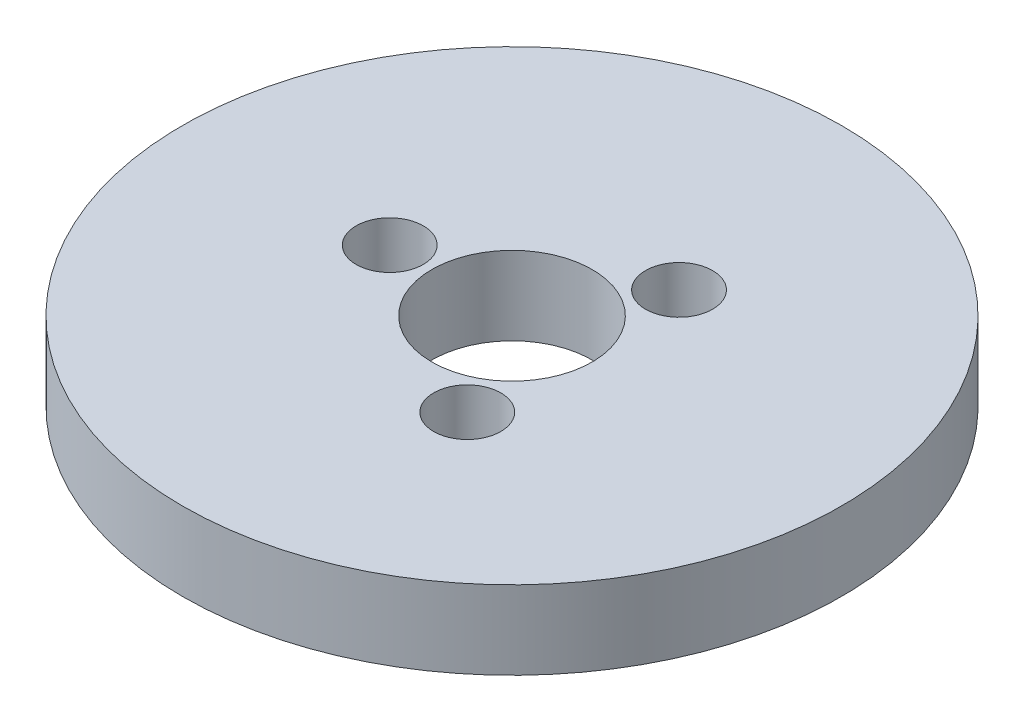
ISO-10303-21;
HEADER;
FILE_DESCRIPTION(('STEP AP214'),'2;1');
FILE_NAME('part.step','',(''),(''),'','','');
FILE_SCHEMA(('AUTOMOTIVE_DESIGN { 1 0 10303 214 1 1 1 1 }'));
ENDSEC;
DATA;
#1=APPLICATION_CONTEXT('core data for automotive mechanical design processes');
#2=APPLICATION_PROTOCOL_DEFINITION('international standard','automotive_design',2000,#1);
#3=PRODUCT_CONTEXT('',#1,'mechanical');
#4=PRODUCT('Part','Part','',(#3));
#5=PRODUCT_RELATED_PRODUCT_CATEGORY('part','',(#4));
#6=PRODUCT_DEFINITION_FORMATION('','',#4);
#7=PRODUCT_DEFINITION_CONTEXT('part definition',#1,'design');
#8=PRODUCT_DEFINITION('design','',#6,#7);
#9=PRODUCT_DEFINITION_SHAPE('','',#8);
#10=(LENGTH_UNIT() NAMED_UNIT(*) SI_UNIT(.MILLI.,.METRE.));
#11=(NAMED_UNIT(*) PLANE_ANGLE_UNIT() SI_UNIT($,.RADIAN.));
#12=(NAMED_UNIT(*) SI_UNIT($,.STERADIAN.) SOLID_ANGLE_UNIT());
#13=UNCERTAINTY_MEASURE_WITH_UNIT(LENGTH_MEASURE(1.E-05),#10,'distance_accuracy_value','');
#14=(GEOMETRIC_REPRESENTATION_CONTEXT(3) GLOBAL_UNCERTAINTY_ASSIGNED_CONTEXT((#13)) GLOBAL_UNIT_ASSIGNED_CONTEXT((#10,
#11,#12)) REPRESENTATION_CONTEXT('',''));
#15=CARTESIAN_POINT('',(0.,0.,0.));
#16=DIRECTION('',(0.,0.,1.));
#17=DIRECTION('',(1.,0.,0.));
#18=AXIS2_PLACEMENT_3D('',#15,#16,#17);
#19=CARTESIAN_POINT('',(0.,22.,0.));
#20=DIRECTION('',(0.,-1.,0.));
#21=DIRECTION('',(0.,0.,-1.));
#22=AXIS2_PLACEMENT_3D('',#19,#20,#21);
#23=CYLINDRICAL_SURFACE('',#22,92.5);
#24=CARTESIAN_POINT('',(0.,22.,0.));
#25=DIRECTION('',(0.,1.,0.));
#26=DIRECTION('',(0.,0.,1.));
#27=AXIS2_PLACEMENT_3D('',#24,#25,#26);
#28=CIRCLE('',#27,92.5);
#29=CARTESIAN_POINT('',(0.,22.,92.5));
#30=VERTEX_POINT('',#29);
#31=EDGE_CURVE('E10',#30,#30,#28,.T.);
#32=ORIENTED_EDGE('',*,*,#31,.F.);
#33=EDGE_LOOP('',(#32));
#34=FACE_BOUND('',#33,.T.);
#35=CARTESIAN_POINT('',(0.,0.,0.));
#36=DIRECTION('',(0.,1.,0.));
#37=DIRECTION('',(0.,0.,1.));
#38=AXIS2_PLACEMENT_3D('',#35,#36,#37);
#39=CIRCLE('',#38,92.5);
#40=CARTESIAN_POINT('',(0.,0.,92.5));
#41=VERTEX_POINT('',#40);
#42=EDGE_CURVE('E37',#41,#41,#39,.T.);
#43=ORIENTED_EDGE('',*,*,#42,.T.);
#44=EDGE_LOOP('',(#43));
#45=FACE_BOUND('',#44,.T.);
#46=ADVANCED_FACE('F40',(#34,#45),#23,.T.);
#47=CARTESIAN_POINT('',(0.,22.,0.));
#48=DIRECTION('',(0.,1.,0.));
#49=DIRECTION('',(0.,0.,1.));
#50=AXIS2_PLACEMENT_3D('',#47,#48,#49);
#51=PLANE('',#50);
#52=CARTESIAN_POINT('',(17.1618556363531,22.,29.7252059143255));
#53=DIRECTION('',(0.,1.,0.));
#54=DIRECTION('',(0.866025403784436,0.,-0.500000000000004));
#55=AXIS2_PLACEMENT_3D('',#52,#53,#54);
#56=CIRCLE('',#55,9.41448918018023);
#57=CARTESIAN_POINT('',(25.3150424300429,22.,25.0179613242354));
#58=VERTEX_POINT('',#57);
#59=EDGE_CURVE('E70',#58,#58,#56,.T.);
#60=ORIENTED_EDGE('',*,*,#59,.F.);
#61=EDGE_LOOP('',(#60));
#62=FACE_BOUND('',#61,.T.);
#63=CARTESIAN_POINT('',(17.1618556363527,22.,-29.7252059143258));
#64=DIRECTION('',(0.,1.,0.));
#65=DIRECTION('',(-0.866025403784443,0.,-0.499999999999992));
#66=AXIS2_PLACEMENT_3D('',#63,#64,#65);
#67=CIRCLE('',#66,9.41448918018023);
#68=CARTESIAN_POINT('',(9.00866884266282,22.,-34.4324505044158));
#69=VERTEX_POINT('',#68);
#70=EDGE_CURVE('E61',#69,#69,#67,.T.);
#71=ORIENTED_EDGE('',*,*,#70,.F.);
#72=EDGE_LOOP('',(#71));
#73=FACE_BOUND('',#72,.T.);
#74=CARTESIAN_POINT('',(-34.3237112727059,22.,0.));
#75=DIRECTION('',(0.,1.,0.));
#76=DIRECTION('',(0.,0.,1.));
#77=AXIS2_PLACEMENT_3D('',#74,#75,#76);
#78=CIRCLE('',#77,9.41448918018023);
#79=CARTESIAN_POINT('',(-34.3237112727059,22.,9.41448918018023));
#80=VERTEX_POINT('',#79);
#81=EDGE_CURVE('E54',#80,#80,#78,.T.);
#82=ORIENTED_EDGE('',*,*,#81,.F.);
#83=EDGE_LOOP('',(#82));
#84=FACE_BOUND('',#83,.T.);
#85=CARTESIAN_POINT('',(0.,22.,0.));
#86=DIRECTION('',(0.,1.,0.));
#87=DIRECTION('',(0.,0.,1.));
#88=AXIS2_PLACEMENT_3D('',#85,#86,#87);
#89=CIRCLE('',#88,22.5);
#90=CARTESIAN_POINT('',(0.,22.,22.5));
#91=VERTEX_POINT('',#90);
#92=EDGE_CURVE('E50',#91,#91,#89,.T.);
#93=ORIENTED_EDGE('',*,*,#92,.F.);
#94=EDGE_LOOP('',(#93));
#95=FACE_BOUND('',#94,.T.);
#96=ORIENTED_EDGE('',*,*,#31,.T.);
#97=EDGE_LOOP('',(#96));
#98=FACE_BOUND('',#97,.T.);
#99=ADVANCED_FACE('F85',(#62,#73,#84,#95,#98),#51,.T.);
#100=CARTESIAN_POINT('',(0.,0.,0.));
#101=DIRECTION('',(0.,1.,0.));
#102=DIRECTION('',(0.,0.,1.));
#103=AXIS2_PLACEMENT_3D('',#100,#101,#102);
#104=PLANE('',#103);
#105=CARTESIAN_POINT('',(0.,0.,0.));
#106=DIRECTION('',(0.,1.,0.));
#107=DIRECTION('',(0.,0.,1.));
#108=AXIS2_PLACEMENT_3D('',#105,#106,#107);
#109=CIRCLE('',#108,22.5);
#110=CARTESIAN_POINT('',(0.,0.,22.5));
#111=VERTEX_POINT('',#110);
#112=EDGE_CURVE('E47',#111,#111,#109,.T.);
#113=ORIENTED_EDGE('',*,*,#112,.T.);
#114=EDGE_LOOP('',(#113));
#115=FACE_BOUND('',#114,.T.);
#116=ORIENTED_EDGE('',*,*,#42,.F.);
#117=EDGE_LOOP('',(#116));
#118=FACE_BOUND('',#117,.T.);
#119=ADVANCED_FACE('F84',(#115,#118),#104,.F.);
#120=CARTESIAN_POINT('',(0.,22.,0.));
#121=DIRECTION('',(0.,-1.,0.));
#122=DIRECTION('',(0.,0.,-1.));
#123=AXIS2_PLACEMENT_3D('',#120,#121,#122);
#124=CYLINDRICAL_SURFACE('',#123,22.5);
#125=ORIENTED_EDGE('',*,*,#92,.T.);
#126=EDGE_LOOP('',(#125));
#127=FACE_BOUND('',#126,.T.);
#128=ORIENTED_EDGE('',*,*,#112,.F.);
#129=EDGE_LOOP('',(#128));
#130=FACE_BOUND('',#129,.T.);
#131=ADVANCED_FACE('F91',(#127,#130),#124,.F.);
#132=CARTESIAN_POINT('',(-34.3237112727059,3.00441496982257,0.));
#133=DIRECTION('',(0.,1.,0.));
#134=DIRECTION('',(0.,0.,1.));
#135=AXIS2_PLACEMENT_3D('',#132,#133,#134);
#136=CYLINDRICAL_SURFACE('',#135,9.41448918018023);
#137=CARTESIAN_POINT('',(-34.3237112727059,3.00441496982257,0.));
#138=DIRECTION('',(0.,1.,0.));
#139=DIRECTION('',(0.,0.,1.));
#140=AXIS2_PLACEMENT_3D('',#137,#138,#139);
#141=CIRCLE('',#140,9.41448918018023);
#142=CARTESIAN_POINT('',(-34.3237112727059,3.00441496982257,9.41448918018023));
#143=VERTEX_POINT('',#142);
#144=EDGE_CURVE('E55',#143,#143,#141,.T.);
#145=ORIENTED_EDGE('',*,*,#144,.F.);
#146=EDGE_LOOP('',(#145));
#147=FACE_BOUND('',#146,.T.);
#148=ORIENTED_EDGE('',*,*,#81,.T.);
#149=EDGE_LOOP('',(#148));
#150=FACE_BOUND('',#149,.T.);
#151=ADVANCED_FACE('F96',(#147,#150),#136,.F.);
#152=CARTESIAN_POINT('',(-34.3237112727059,3.00441496982257,0.));
#153=DIRECTION('',(0.,1.,0.));
#154=DIRECTION('',(0.,0.,1.));
#155=AXIS2_PLACEMENT_3D('',#152,#153,#154);
#156=PLANE('',#155);
#157=ORIENTED_EDGE('',*,*,#144,.T.);
#158=EDGE_LOOP('',(#157));
#159=FACE_BOUND('',#158,.T.);
#160=ADVANCED_FACE('F127',(#159),#156,.T.);
#161=CARTESIAN_POINT('',(17.1618556363527,3.00441496982257,-29.7252059143258));
#162=DIRECTION('',(0.,1.,0.));
#163=DIRECTION('',(0.,0.,1.));
#164=AXIS2_PLACEMENT_3D('',#161,#162,#163);
#165=CYLINDRICAL_SURFACE('',#164,9.41448918018023);
#166=CARTESIAN_POINT('',(17.1618556363527,3.00441496982257,-29.7252059143258));
#167=DIRECTION('',(0.,1.,0.));
#168=DIRECTION('',(-0.866025403784443,0.,-0.499999999999992));
#169=AXIS2_PLACEMENT_3D('',#166,#167,#168);
#170=CIRCLE('',#169,9.41448918018023);
#171=CARTESIAN_POINT('',(9.00866884266282,3.00441496982257,-34.4324505044158));
#172=VERTEX_POINT('',#171);
#173=EDGE_CURVE('E63',#172,#172,#170,.T.);
#174=ORIENTED_EDGE('',*,*,#173,.F.);
#175=EDGE_LOOP('',(#174));
#176=FACE_BOUND('',#175,.T.);
#177=ORIENTED_EDGE('',*,*,#70,.T.);
#178=EDGE_LOOP('',(#177));
#179=FACE_BOUND('',#178,.T.);
#180=ADVANCED_FACE('F133',(#176,#179),#165,.F.);
#181=CARTESIAN_POINT('',(17.1618556363527,3.00441496982257,-29.7252059143258));
#182=DIRECTION('',(0.,1.,0.));
#183=DIRECTION('',(-0.866025403784443,0.,-0.499999999999992));
#184=AXIS2_PLACEMENT_3D('',#181,#182,#183);
#185=PLANE('',#184);
#186=ORIENTED_EDGE('',*,*,#173,.T.);
#187=EDGE_LOOP('',(#186));
#188=FACE_BOUND('',#187,.T.);
#189=ADVANCED_FACE('F77',(#188),#185,.T.);
#190=CARTESIAN_POINT('',(17.1618556363531,3.00441496982257,29.7252059143255));
#191=DIRECTION('',(0.,1.,0.));
#192=DIRECTION('',(0.,0.,1.));
#193=AXIS2_PLACEMENT_3D('',#190,#191,#192);
#194=CYLINDRICAL_SURFACE('',#193,9.41448918018023);
#195=CARTESIAN_POINT('',(17.1618556363531,3.00441496982257,29.7252059143255));
#196=DIRECTION('',(0.,1.,0.));
#197=DIRECTION('',(0.866025403784436,0.,-0.500000000000004));
#198=AXIS2_PLACEMENT_3D('',#195,#196,#197);
#199=CIRCLE('',#198,9.41448918018023);
#200=CARTESIAN_POINT('',(25.3150424300429,3.00441496982257,25.0179613242354));
#201=VERTEX_POINT('',#200);
#202=EDGE_CURVE('E59',#201,#201,#199,.T.);
#203=ORIENTED_EDGE('',*,*,#202,.F.);
#204=EDGE_LOOP('',(#203));
#205=FACE_BOUND('',#204,.T.);
#206=ORIENTED_EDGE('',*,*,#59,.T.);
#207=EDGE_LOOP('',(#206));
#208=FACE_BOUND('',#207,.T.);
#209=ADVANCED_FACE('F73',(#205,#208),#194,.F.);
#210=CARTESIAN_POINT('',(17.1618556363531,3.00441496982257,29.7252059143255));
#211=DIRECTION('',(0.,1.,0.));
#212=DIRECTION('',(0.866025403784436,0.,-0.500000000000004));
#213=AXIS2_PLACEMENT_3D('',#210,#211,#212);
#214=PLANE('',#213);
#215=ORIENTED_EDGE('',*,*,#202,.T.);
#216=EDGE_LOOP('',(#215));
#217=FACE_BOUND('',#216,.T.);
#218=ADVANCED_FACE('F71',(#217),#214,.T.);
#219=CLOSED_SHELL('',(#46,#99,#119,#131,#151,#160,#180,#189,#209,#218));
#220=MANIFOLD_SOLID_BREP('B2',#219);
#221=ADVANCED_BREP_SHAPE_REPRESENTATION('',(#18,#220),#14);
#222=SHAPE_DEFINITION_REPRESENTATION(#9,#221);
ENDSEC;
END-ISO-10303-21;
